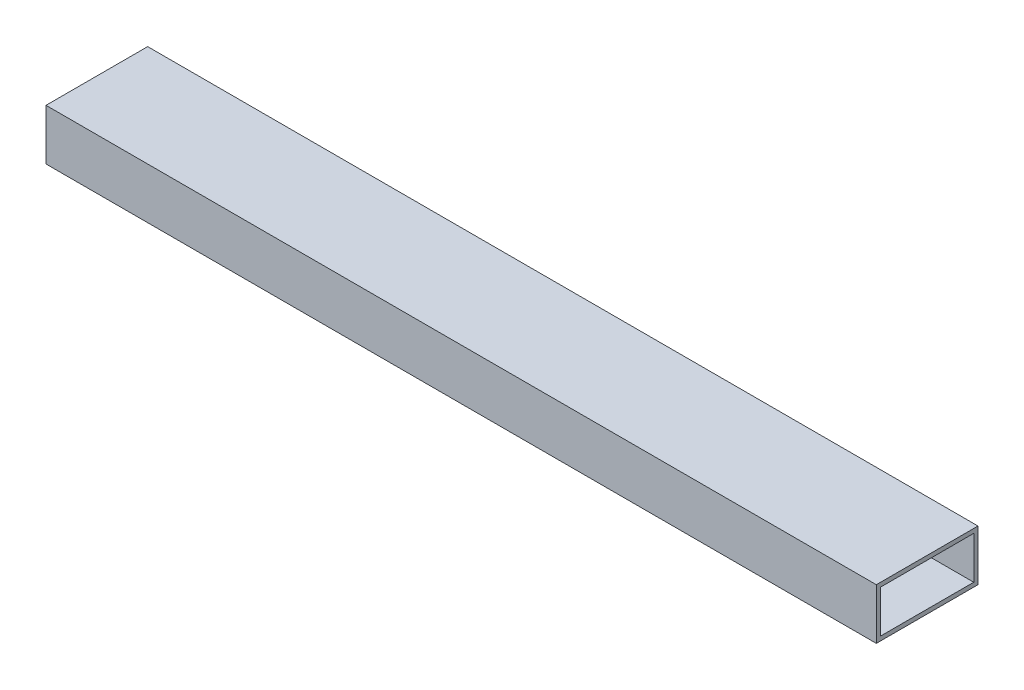
ISO-10303-21;
HEADER;
FILE_DESCRIPTION(('STEP AP214'),'2;1');
FILE_NAME('part.step','',(''),(''),'','','');
FILE_SCHEMA(('AUTOMOTIVE_DESIGN { 1 0 10303 214 1 1 1 1 }'));
ENDSEC;
DATA;
#1=APPLICATION_CONTEXT('core data for automotive mechanical design processes');
#2=APPLICATION_PROTOCOL_DEFINITION('international standard','automotive_design',2000,#1);
#3=PRODUCT_CONTEXT('',#1,'mechanical');
#4=PRODUCT('Part','Part','',(#3));
#5=PRODUCT_RELATED_PRODUCT_CATEGORY('part','',(#4));
#6=PRODUCT_DEFINITION_FORMATION('','',#4);
#7=PRODUCT_DEFINITION_CONTEXT('part definition',#1,'design');
#8=PRODUCT_DEFINITION('design','',#6,#7);
#9=PRODUCT_DEFINITION_SHAPE('','',#8);
#10=(LENGTH_UNIT() NAMED_UNIT(*) SI_UNIT(.MILLI.,.METRE.));
#11=(NAMED_UNIT(*) PLANE_ANGLE_UNIT() SI_UNIT($,.RADIAN.));
#12=(NAMED_UNIT(*) SI_UNIT($,.STERADIAN.) SOLID_ANGLE_UNIT());
#13=UNCERTAINTY_MEASURE_WITH_UNIT(LENGTH_MEASURE(1.E-05),#10,'distance_accuracy_value','');
#14=(GEOMETRIC_REPRESENTATION_CONTEXT(3) GLOBAL_UNCERTAINTY_ASSIGNED_CONTEXT((#13)) GLOBAL_UNIT_ASSIGNED_CONTEXT((#10,
#11,#12)) REPRESENTATION_CONTEXT('',''));
#15=CARTESIAN_POINT('',(0.,0.,0.));
#16=DIRECTION('',(0.,0.,1.));
#17=DIRECTION('',(1.,0.,0.));
#18=AXIS2_PLACEMENT_3D('',#15,#16,#17);
#19=CARTESIAN_POINT('',(311.15,-2.77555756156289E-13,4.31807367640147E-13));
#20=DIRECTION('',(1.,0.,0.));
#21=DIRECTION('',(0.,0.,-1.));
#22=AXIS2_PLACEMENT_3D('',#19,#20,#21);
#23=PLANE('',#22);
#24=DIRECTION('',(0.,1.,0.));
#25=VECTOR('',#24,1.);
#26=CARTESIAN_POINT('',(311.15,-2.77555756156289E-13,-76.1999999999996));
#27=LINE('',#26,#25);
#28=CARTESIAN_POINT('',(311.15,-2.77555756156289E-13,-76.1999999999996));
#29=VERTEX_POINT('',#28);
#30=CARTESIAN_POINT('',(311.15,38.1,-76.1999999999996));
#31=VERTEX_POINT('',#30);
#32=EDGE_CURVE('E151',#29,#31,#27,.T.);
#33=ORIENTED_EDGE('',*,*,#32,.T.);
#34=DIRECTION('',(0.,0.,1.));
#35=VECTOR('',#34,1.);
#36=CARTESIAN_POINT('',(311.15,38.1,-76.1999999999996));
#37=LINE('',#36,#35);
#38=CARTESIAN_POINT('',(311.15,38.1,4.2486847373624E-13));
#39=VERTEX_POINT('',#38);
#40=EDGE_CURVE('E154',#31,#39,#37,.T.);
#41=ORIENTED_EDGE('',*,*,#40,.T.);
#42=DIRECTION('',(0.,-1.,0.));
#43=VECTOR('',#42,1.);
#44=CARTESIAN_POINT('',(311.15,-2.77555756156289E-13,4.31807367640147E-13));
#45=LINE('',#44,#43);
#46=CARTESIAN_POINT('',(311.15,-2.77555756156289E-13,4.31807367640147E-13));
#47=VERTEX_POINT('',#46);
#48=EDGE_CURVE('E157',#39,#47,#45,.T.);
#49=ORIENTED_EDGE('',*,*,#48,.T.);
#50=DIRECTION('',(0.,0.,-1.));
#51=VECTOR('',#50,1.);
#52=CARTESIAN_POINT('',(311.15,-2.77555756156289E-13,-76.1999999999996));
#53=LINE('',#52,#51);
#54=EDGE_CURVE('E159',#47,#29,#53,.T.);
#55=ORIENTED_EDGE('',*,*,#54,.T.);
#56=EDGE_LOOP('',(#33,#41,#49,#55));
#57=FACE_BOUND('',#56,.T.);
#58=DIRECTION('',(0.,0.,1.));
#59=VECTOR('',#58,1.);
#60=CARTESIAN_POINT('',(311.15,34.925,-73.0249999999996));
#61=LINE('',#60,#59);
#62=CARTESIAN_POINT('',(311.15,34.925,-73.0249999999996));
#63=VERTEX_POINT('',#62);
#64=CARTESIAN_POINT('',(311.15,34.925,-3.17499999999957));
#65=VERTEX_POINT('',#64);
#66=EDGE_CURVE('E121',#63,#65,#61,.T.);
#67=ORIENTED_EDGE('',*,*,#66,.F.);
#68=DIRECTION('',(0.,1.,0.));
#69=VECTOR('',#68,1.);
#70=CARTESIAN_POINT('',(311.15,3.17499999999976,-73.0249999999996));
#71=LINE('',#70,#69);
#72=CARTESIAN_POINT('',(311.15,3.17499999999976,-73.0249999999996));
#73=VERTEX_POINT('',#72);
#74=EDGE_CURVE('E113',#73,#63,#71,.T.);
#75=ORIENTED_EDGE('',*,*,#74,.F.);
#76=DIRECTION('',(0.,0.,-1.));
#77=VECTOR('',#76,1.);
#78=CARTESIAN_POINT('',(311.15,3.17499999999976,-73.0249999999996));
#79=LINE('',#78,#77);
#80=CARTESIAN_POINT('',(311.15,3.17499999999976,-3.17499999999957));
#81=VERTEX_POINT('',#80);
#82=EDGE_CURVE('E135',#81,#73,#79,.T.);
#83=ORIENTED_EDGE('',*,*,#82,.F.);
#84=DIRECTION('',(0.,-1.,0.));
#85=VECTOR('',#84,1.);
#86=CARTESIAN_POINT('',(311.15,3.17499999999976,-3.17499999999957));
#87=LINE('',#86,#85);
#88=EDGE_CURVE('E133',#65,#81,#87,.T.);
#89=ORIENTED_EDGE('',*,*,#88,.F.);
#90=EDGE_LOOP('',(#67,#75,#83,#89));
#91=FACE_BOUND('',#90,.T.);
#92=ADVANCED_FACE('F48',(#57,#91),#23,.T.);
#93=CARTESIAN_POINT('',(-311.15,0.,-4.31807367640147E-13));
#94=DIRECTION('',(1.,0.,0.));
#95=DIRECTION('',(0.,0.,-1.));
#96=AXIS2_PLACEMENT_3D('',#93,#94,#95);
#97=PLANE('',#96);
#98=DIRECTION('',(0.,1.,0.));
#99=VECTOR('',#98,1.);
#100=CARTESIAN_POINT('',(-311.15,0.,-76.2000000000004));
#101=LINE('',#100,#99);
#102=CARTESIAN_POINT('',(-311.15,0.,-76.2000000000004));
#103=VERTEX_POINT('',#102);
#104=CARTESIAN_POINT('',(-311.15,38.0999999999999,-76.2000000000004));
#105=VERTEX_POINT('',#104);
#106=EDGE_CURVE('E129',#103,#105,#101,.T.);
#107=ORIENTED_EDGE('',*,*,#106,.F.);
#108=DIRECTION('',(0.,0.,-1.));
#109=VECTOR('',#108,1.);
#110=CARTESIAN_POINT('',(-311.15,0.,-76.2000000000004));
#111=LINE('',#110,#109);
#112=CARTESIAN_POINT('',(-311.15,0.,-4.31807367640147E-13));
#113=VERTEX_POINT('',#112);
#114=EDGE_CURVE('E155',#113,#103,#111,.T.);
#115=ORIENTED_EDGE('',*,*,#114,.F.);
#116=DIRECTION('',(0.,-1.,0.));
#117=VECTOR('',#116,1.);
#118=CARTESIAN_POINT('',(-311.15,0.,-4.31807367640147E-13));
#119=LINE('',#118,#117);
#120=CARTESIAN_POINT('',(-311.15,38.1,-4.38746261544054E-13));
#121=VERTEX_POINT('',#120);
#122=EDGE_CURVE('E166',#121,#113,#119,.T.);
#123=ORIENTED_EDGE('',*,*,#122,.F.);
#124=DIRECTION('',(0.,0.,1.));
#125=VECTOR('',#124,1.);
#126=CARTESIAN_POINT('',(-311.15,38.0999999999999,-76.2000000000004));
#127=LINE('',#126,#125);
#128=EDGE_CURVE('E164',#105,#121,#127,.T.);
#129=ORIENTED_EDGE('',*,*,#128,.F.);
#130=EDGE_LOOP('',(#107,#115,#123,#129));
#131=FACE_BOUND('',#130,.T.);
#132=DIRECTION('',(0.,1.,0.));
#133=VECTOR('',#132,1.);
#134=CARTESIAN_POINT('',(-311.15,3.17499999999998,-73.0250000000004));
#135=LINE('',#134,#133);
#136=CARTESIAN_POINT('',(-311.15,3.17499999999998,-73.0250000000004));
#137=VERTEX_POINT('',#136);
#138=CARTESIAN_POINT('',(-311.15,34.925,-73.0250000000004));
#139=VERTEX_POINT('',#138);
#140=EDGE_CURVE('E71',#137,#139,#135,.T.);
#141=ORIENTED_EDGE('',*,*,#140,.T.);
#142=DIRECTION('',(0.,0.,1.));
#143=VECTOR('',#142,1.);
#144=CARTESIAN_POINT('',(-311.15,34.925,-73.0250000000004));
#145=LINE('',#144,#143);
#146=CARTESIAN_POINT('',(-311.15,34.925,-3.17500000000043));
#147=VERTEX_POINT('',#146);
#148=EDGE_CURVE('E128',#139,#147,#145,.T.);
#149=ORIENTED_EDGE('',*,*,#148,.T.);
#150=DIRECTION('',(0.,-1.,0.));
#151=VECTOR('',#150,1.);
#152=CARTESIAN_POINT('',(-311.15,3.17499999999998,-3.17500000000043));
#153=LINE('',#152,#151);
#154=CARTESIAN_POINT('',(-311.15,3.17499999999998,-3.17500000000043));
#155=VERTEX_POINT('',#154);
#156=EDGE_CURVE('E143',#147,#155,#153,.T.);
#157=ORIENTED_EDGE('',*,*,#156,.T.);
#158=DIRECTION('',(0.,0.,-1.));
#159=VECTOR('',#158,1.);
#160=CARTESIAN_POINT('',(-311.15,3.17499999999998,-73.0250000000004));
#161=LINE('',#160,#159);
#162=EDGE_CURVE('E122',#155,#137,#161,.T.);
#163=ORIENTED_EDGE('',*,*,#162,.T.);
#164=EDGE_LOOP('',(#141,#149,#157,#163));
#165=FACE_BOUND('',#164,.T.);
#166=ADVANCED_FACE('F184',(#131,#165),#97,.F.);
#167=CARTESIAN_POINT('',(311.15,-2.77555756156289E-13,-76.1999999999996));
#168=DIRECTION('',(0.,0.,1.));
#169=DIRECTION('',(0.,-1.,0.));
#170=AXIS2_PLACEMENT_3D('',#167,#168,#169);
#171=PLANE('',#170);
#172=CARTESIAN_POINT('',(-260.35,19.0499999999999,-76.2000000000003));
#173=DIRECTION('',(0.,0.,-1.));
#174=DIRECTION('',(0.,1.,0.));
#175=AXIS2_PLACEMENT_3D('',#172,#173,#174);
#176=CIRCLE('',#175,2.55269999999996);
#177=CARTESIAN_POINT('',(-260.35,21.6026999999998,-76.2000000000003));
#178=VERTEX_POINT('',#177);
#179=EDGE_CURVE('E232',#178,#178,#176,.T.);
#180=ORIENTED_EDGE('',*,*,#179,.F.);
#181=EDGE_LOOP('',(#180));
#182=FACE_BOUND('',#181,.T.);
#183=CARTESIAN_POINT('',(260.35,19.05,-76.1999999999996));
#184=DIRECTION('',(0.,0.,-1.));
#185=DIRECTION('',(0.,1.,0.));
#186=AXIS2_PLACEMENT_3D('',#183,#184,#185);
#187=CIRCLE('',#186,2.55269999999996);
#188=CARTESIAN_POINT('',(260.35,21.6026999999999,-76.1999999999996));
#189=VERTEX_POINT('',#188);
#190=EDGE_CURVE('E227',#189,#189,#187,.T.);
#191=ORIENTED_EDGE('',*,*,#190,.F.);
#192=EDGE_LOOP('',(#191));
#193=FACE_BOUND('',#192,.T.);
#194=ORIENTED_EDGE('',*,*,#106,.T.);
#195=DIRECTION('',(-1.,0.,0.));
#196=VECTOR('',#195,1.);
#197=CARTESIAN_POINT('',(311.15,38.1,-76.1999999999996));
#198=LINE('',#197,#196);
#199=EDGE_CURVE('E13',#31,#105,#198,.T.);
#200=ORIENTED_EDGE('',*,*,#199,.F.);
#201=ORIENTED_EDGE('',*,*,#32,.F.);
#202=DIRECTION('',(-1.,0.,0.));
#203=VECTOR('',#202,1.);
#204=CARTESIAN_POINT('',(311.15,-2.77555756156289E-13,-76.1999999999996));
#205=LINE('',#204,#203);
#206=EDGE_CURVE('E161',#29,#103,#205,.T.);
#207=ORIENTED_EDGE('',*,*,#206,.T.);
#208=EDGE_LOOP('',(#194,#200,#201,#207));
#209=FACE_BOUND('',#208,.T.);
#210=ADVANCED_FACE('F50',(#182,#193,#209),#171,.F.);
#211=CARTESIAN_POINT('',(311.15,38.1,-76.1999999999996));
#212=DIRECTION('',(0.,-1.,0.));
#213=DIRECTION('',(0.,0.,-1.));
#214=AXIS2_PLACEMENT_3D('',#211,#212,#213);
#215=PLANE('',#214);
#216=ORIENTED_EDGE('',*,*,#128,.T.);
#217=DIRECTION('',(-1.,0.,0.));
#218=VECTOR('',#217,1.);
#219=CARTESIAN_POINT('',(311.15,38.1,4.2486847373624E-13));
#220=LINE('',#219,#218);
#221=EDGE_CURVE('E56',#39,#121,#220,.T.);
#222=ORIENTED_EDGE('',*,*,#221,.F.);
#223=ORIENTED_EDGE('',*,*,#40,.F.);
#224=ORIENTED_EDGE('',*,*,#199,.T.);
#225=EDGE_LOOP('',(#216,#222,#223,#224));
#226=FACE_BOUND('',#225,.T.);
#227=ADVANCED_FACE('F194',(#226),#215,.F.);
#228=CARTESIAN_POINT('',(311.15,-2.77555756156289E-13,4.31807367640147E-13));
#229=DIRECTION('',(0.,0.,-1.));
#230=DIRECTION('',(0.,1.,0.));
#231=AXIS2_PLACEMENT_3D('',#228,#229,#230);
#232=PLANE('',#231);
#233=ORIENTED_EDGE('',*,*,#122,.T.);
#234=DIRECTION('',(-1.,0.,0.));
#235=VECTOR('',#234,1.);
#236=CARTESIAN_POINT('',(311.15,-2.77555756156289E-13,4.31807367640147E-13));
#237=LINE('',#236,#235);
#238=EDGE_CURVE('E171',#47,#113,#237,.T.);
#239=ORIENTED_EDGE('',*,*,#238,.F.);
#240=ORIENTED_EDGE('',*,*,#48,.F.);
#241=ORIENTED_EDGE('',*,*,#221,.T.);
#242=EDGE_LOOP('',(#233,#239,#240,#241));
#243=FACE_BOUND('',#242,.T.);
#244=ADVANCED_FACE('F178',(#243),#232,.F.);
#245=CARTESIAN_POINT('',(311.15,-2.77555756156289E-13,-76.1999999999996));
#246=DIRECTION('',(0.,1.,0.));
#247=DIRECTION('',(0.,0.,1.));
#248=AXIS2_PLACEMENT_3D('',#245,#246,#247);
#249=PLANE('',#248);
#250=ORIENTED_EDGE('',*,*,#114,.T.);
#251=ORIENTED_EDGE('',*,*,#206,.F.);
#252=ORIENTED_EDGE('',*,*,#54,.F.);
#253=ORIENTED_EDGE('',*,*,#238,.T.);
#254=EDGE_LOOP('',(#250,#251,#252,#253));
#255=FACE_BOUND('',#254,.T.);
#256=ADVANCED_FACE('F188',(#255),#249,.F.);
#257=CARTESIAN_POINT('',(311.15,3.17499999999976,-73.0249999999996));
#258=DIRECTION('',(0.,0.,1.));
#259=DIRECTION('',(1.,0.,0.));
#260=AXIS2_PLACEMENT_3D('',#257,#258,#259);
#261=PLANE('',#260);
#262=CARTESIAN_POINT('',(-260.35,19.0499999999999,-73.0250000000003));
#263=DIRECTION('',(0.,0.,1.));
#264=DIRECTION('',(1.,0.,0.));
#265=AXIS2_PLACEMENT_3D('',#262,#263,#264);
#266=CIRCLE('',#265,2.55269999999999);
#267=CARTESIAN_POINT('',(-257.7973,19.0499999999999,-73.0250000000003));
#268=VERTEX_POINT('',#267);
#269=EDGE_CURVE('E223',#268,#268,#266,.T.);
#270=ORIENTED_EDGE('',*,*,#269,.F.);
#271=EDGE_LOOP('',(#270));
#272=FACE_BOUND('',#271,.T.);
#273=CARTESIAN_POINT('',(260.35,19.05,-73.0249999999996));
#274=DIRECTION('',(0.,0.,1.));
#275=DIRECTION('',(1.,0.,0.));
#276=AXIS2_PLACEMENT_3D('',#273,#274,#275);
#277=CIRCLE('',#276,2.55269999999999);
#278=CARTESIAN_POINT('',(262.9027,19.05,-73.0249999999996));
#279=VERTEX_POINT('',#278);
#280=EDGE_CURVE('E141',#279,#279,#277,.T.);
#281=ORIENTED_EDGE('',*,*,#280,.F.);
#282=EDGE_LOOP('',(#281));
#283=FACE_BOUND('',#282,.T.);
#284=ORIENTED_EDGE('',*,*,#140,.F.);
#285=DIRECTION('',(-1.,0.,0.));
#286=VECTOR('',#285,1.);
#287=CARTESIAN_POINT('',(311.15,3.17499999999976,-73.0249999999996));
#288=LINE('',#287,#286);
#289=EDGE_CURVE('E117',#73,#137,#288,.T.);
#290=ORIENTED_EDGE('',*,*,#289,.F.);
#291=ORIENTED_EDGE('',*,*,#74,.T.);
#292=DIRECTION('',(-1.,0.,0.));
#293=VECTOR('',#292,1.);
#294=CARTESIAN_POINT('',(311.15,34.925,-73.0249999999996));
#295=LINE('',#294,#293);
#296=EDGE_CURVE('E116',#63,#139,#295,.T.);
#297=ORIENTED_EDGE('',*,*,#296,.T.);
#298=EDGE_LOOP('',(#284,#290,#291,#297));
#299=FACE_BOUND('',#298,.T.);
#300=ADVANCED_FACE('F115',(#272,#283,#299),#261,.T.);
#301=CARTESIAN_POINT('',(311.15,34.925,-73.0249999999996));
#302=DIRECTION('',(0.,-1.,0.));
#303=DIRECTION('',(0.,0.,-1.));
#304=AXIS2_PLACEMENT_3D('',#301,#302,#303);
#305=PLANE('',#304);
#306=ORIENTED_EDGE('',*,*,#148,.F.);
#307=ORIENTED_EDGE('',*,*,#296,.F.);
#308=ORIENTED_EDGE('',*,*,#66,.T.);
#309=DIRECTION('',(-1.,0.,0.));
#310=VECTOR('',#309,1.);
#311=CARTESIAN_POINT('',(311.15,34.925,-3.17499999999957));
#312=LINE('',#311,#310);
#313=EDGE_CURVE('E130',#65,#147,#312,.T.);
#314=ORIENTED_EDGE('',*,*,#313,.T.);
#315=EDGE_LOOP('',(#306,#307,#308,#314));
#316=FACE_BOUND('',#315,.T.);
#317=ADVANCED_FACE('F125',(#316),#305,.T.);
#318=CARTESIAN_POINT('',(311.15,3.17499999999976,-3.17499999999957));
#319=DIRECTION('',(0.,0.,-1.));
#320=DIRECTION('',(-1.,0.,0.));
#321=AXIS2_PLACEMENT_3D('',#318,#319,#320);
#322=PLANE('',#321);
#323=ORIENTED_EDGE('',*,*,#156,.F.);
#324=ORIENTED_EDGE('',*,*,#313,.F.);
#325=ORIENTED_EDGE('',*,*,#88,.T.);
#326=DIRECTION('',(-1.,0.,0.));
#327=VECTOR('',#326,1.);
#328=CARTESIAN_POINT('',(311.15,3.17499999999976,-3.17499999999957));
#329=LINE('',#328,#327);
#330=EDGE_CURVE('E63',#81,#155,#329,.T.);
#331=ORIENTED_EDGE('',*,*,#330,.T.);
#332=EDGE_LOOP('',(#323,#324,#325,#331));
#333=FACE_BOUND('',#332,.T.);
#334=ADVANCED_FACE('F219',(#333),#322,.T.);
#335=CARTESIAN_POINT('',(311.15,3.17499999999976,-73.0249999999996));
#336=DIRECTION('',(0.,1.,0.));
#337=DIRECTION('',(0.,0.,1.));
#338=AXIS2_PLACEMENT_3D('',#335,#336,#337);
#339=PLANE('',#338);
#340=ORIENTED_EDGE('',*,*,#162,.F.);
#341=ORIENTED_EDGE('',*,*,#330,.F.);
#342=ORIENTED_EDGE('',*,*,#82,.T.);
#343=ORIENTED_EDGE('',*,*,#289,.T.);
#344=EDGE_LOOP('',(#340,#341,#342,#343));
#345=FACE_BOUND('',#344,.T.);
#346=ADVANCED_FACE('F243',(#345),#339,.T.);
#347=CARTESIAN_POINT('',(260.35,19.05,-76.1999999999996));
#348=DIRECTION('',(0.,0.,-1.));
#349=DIRECTION('',(0.,1.,0.));
#350=AXIS2_PLACEMENT_3D('',#347,#348,#349);
#351=CYLINDRICAL_SURFACE('',#350,2.55269999999999);
#352=ORIENTED_EDGE('',*,*,#190,.T.);
#353=EDGE_LOOP('',(#352));
#354=FACE_BOUND('',#353,.T.);
#355=ORIENTED_EDGE('',*,*,#280,.T.);
#356=EDGE_LOOP('',(#355));
#357=FACE_BOUND('',#356,.T.);
#358=ADVANCED_FACE('F241',(#354,#357),#351,.F.);
#359=CARTESIAN_POINT('',(-260.35,19.0499999999999,-76.2000000000003));
#360=DIRECTION('',(0.,0.,-1.));
#361=DIRECTION('',(0.,1.,0.));
#362=AXIS2_PLACEMENT_3D('',#359,#360,#361);
#363=CYLINDRICAL_SURFACE('',#362,2.55269999999999);
#364=ORIENTED_EDGE('',*,*,#179,.T.);
#365=EDGE_LOOP('',(#364));
#366=FACE_BOUND('',#365,.T.);
#367=ORIENTED_EDGE('',*,*,#269,.T.);
#368=EDGE_LOOP('',(#367));
#369=FACE_BOUND('',#368,.T.);
#370=ADVANCED_FACE('F236',(#366,#369),#363,.F.);
#371=CLOSED_SHELL('',(#92,#166,#210,#227,#244,#256,#300,#317,#334,#346,#358,#370));
#372=MANIFOLD_SOLID_BREP('B2',#371);
#373=ADVANCED_BREP_SHAPE_REPRESENTATION('',(#18,#372),#14);
#374=SHAPE_DEFINITION_REPRESENTATION(#9,#373);
ENDSEC;
END-ISO-10303-21;
